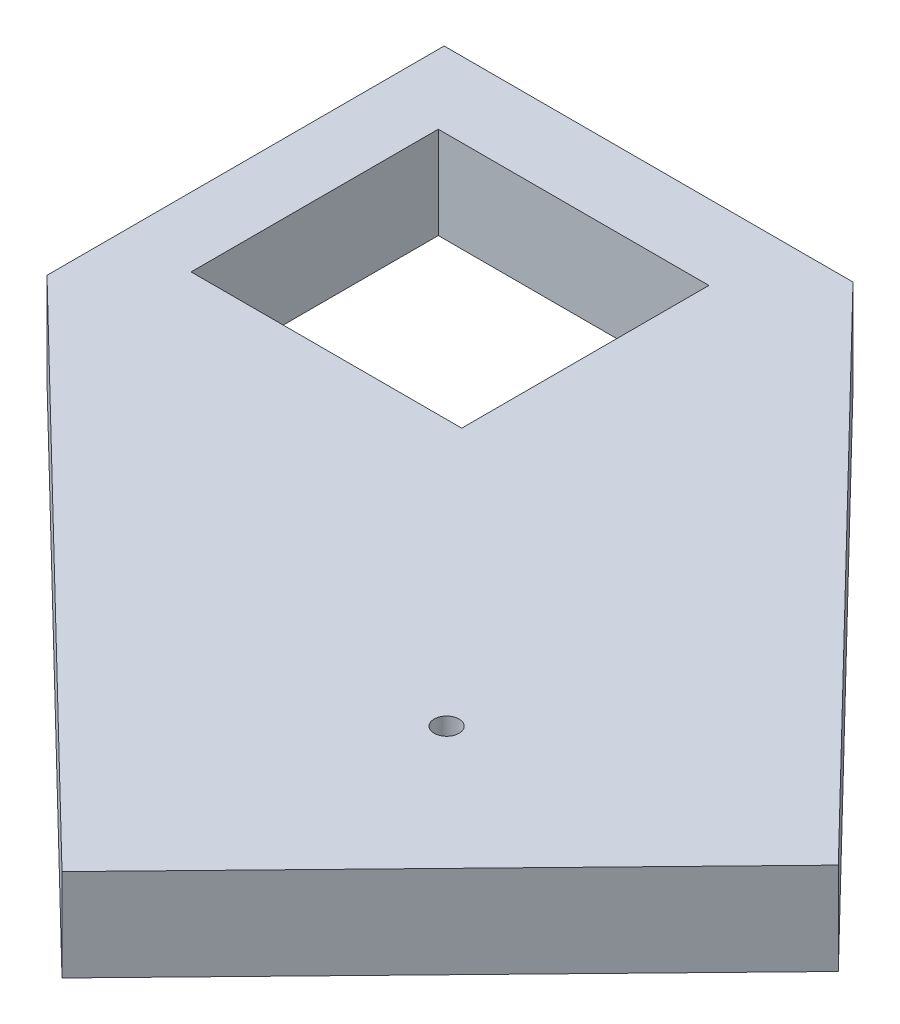
ISO-10303-21;
HEADER;
FILE_DESCRIPTION(('STEP AP214'),'2;1');
FILE_NAME('part.step','',(''),(''),'','','');
FILE_SCHEMA(('AUTOMOTIVE_DESIGN { 1 0 10303 214 1 1 1 1 }'));
ENDSEC;
DATA;
#1=APPLICATION_CONTEXT('core data for automotive mechanical design processes');
#2=APPLICATION_PROTOCOL_DEFINITION('international standard','automotive_design',2000,#1);
#3=PRODUCT_CONTEXT('',#1,'mechanical');
#4=PRODUCT('Part','Part','',(#3));
#5=PRODUCT_RELATED_PRODUCT_CATEGORY('part','',(#4));
#6=PRODUCT_DEFINITION_FORMATION('','',#4);
#7=PRODUCT_DEFINITION_CONTEXT('part definition',#1,'design');
#8=PRODUCT_DEFINITION('design','',#6,#7);
#9=PRODUCT_DEFINITION_SHAPE('','',#8);
#10=(LENGTH_UNIT() NAMED_UNIT(*) SI_UNIT(.MILLI.,.METRE.));
#11=(NAMED_UNIT(*) PLANE_ANGLE_UNIT() SI_UNIT($,.RADIAN.));
#12=(NAMED_UNIT(*) SI_UNIT($,.STERADIAN.) SOLID_ANGLE_UNIT());
#13=UNCERTAINTY_MEASURE_WITH_UNIT(LENGTH_MEASURE(1.E-05),#10,'distance_accuracy_value','');
#14=(GEOMETRIC_REPRESENTATION_CONTEXT(3) GLOBAL_UNCERTAINTY_ASSIGNED_CONTEXT((#13)) GLOBAL_UNIT_ASSIGNED_CONTEXT((#10,
#11,#12)) REPRESENTATION_CONTEXT('',''));
#15=CARTESIAN_POINT('',(0.,0.,0.));
#16=DIRECTION('',(0.,0.,1.));
#17=DIRECTION('',(1.,0.,0.));
#18=AXIS2_PLACEMENT_3D('',#15,#16,#17);
#19=CARTESIAN_POINT('',(0.,0.,0.));
#20=DIRECTION('',(0.,1.,0.));
#21=DIRECTION('',(0.,0.,1.));
#22=AXIS2_PLACEMENT_3D('',#19,#20,#21);
#23=PLANE('',#22);
#24=DIRECTION('',(0.696755470959051,0.,-0.717308729689407));
#25=VECTOR('',#24,1.);
#26=CARTESIAN_POINT('',(112.453231928364,0.,109.231076285717));
#27=LINE('',#26,#25);
#28=CARTESIAN_POINT('',(69.3630866347913,0.,153.592317310664));
#29=VERTEX_POINT('',#28);
#30=CARTESIAN_POINT('',(152.403813044756,0.,68.1020119505532));
#31=VERTEX_POINT('',#30);
#32=EDGE_CURVE('E167',#29,#31,#27,.T.);
#33=ORIENTED_EDGE('',*,*,#32,.F.);
#34=DIRECTION('',(0.717308729689407,0.,0.696755470959051));
#35=VECTOR('',#34,1.);
#36=CARTESIAN_POINT('',(-43.0901452935729,0.,44.3612410249467));
#37=LINE('',#36,#35);
#38=CARTESIAN_POINT('',(-44.3799887495983,0.,43.108355834137));
#39=VERTEX_POINT('',#38);
#40=EDGE_CURVE('E126',#39,#29,#37,.T.);
#41=ORIENTED_EDGE('',*,*,#40,.F.);
#42=DIRECTION('',(0.,0.,1.));
#43=VECTOR('',#42,1.);
#44=CARTESIAN_POINT('',(-44.3799887495983,0.,0.));
#45=LINE('',#44,#43);
#46=CARTESIAN_POINT('',(-44.3799887495983,0.,-43.1083558341369));
#47=VERTEX_POINT('',#46);
#48=EDGE_CURVE('E177',#47,#39,#45,.T.);
#49=ORIENTED_EDGE('',*,*,#48,.F.);
#50=DIRECTION('',(1.,0.,0.));
#51=VECTOR('',#50,1.);
#52=CARTESIAN_POINT('',(0.,0.,-43.1083558341369));
#53=LINE('',#52,#51);
#54=CARTESIAN_POINT('',(44.3799887495983,0.,-43.1083558341369));
#55=VERTEX_POINT('',#54);
#56=EDGE_CURVE('E174',#47,#55,#53,.T.);
#57=ORIENTED_EDGE('',*,*,#56,.T.);
#58=DIRECTION('',(-0.696755470959051,0.,-0.717308729689407));
#59=VECTOR('',#58,1.);
#60=CARTESIAN_POINT('',(44.3799887495982,0.,-43.108355834137));
#61=LINE('',#60,#59);
#62=EDGE_CURVE('E169',#31,#55,#61,.T.);
#63=ORIENTED_EDGE('',*,*,#62,.F.);
#64=EDGE_LOOP('',(#33,#41,#49,#57,#63));
#65=FACE_BOUND('',#64,.T.);
#66=DIRECTION('',(1.,0.,0.));
#67=VECTOR('',#66,1.);
#68=CARTESIAN_POINT('',(0.,0.,-26.8314545162327));
#69=LINE('',#68,#67);
#70=CARTESIAN_POINT('',(-29.3747203471553,0.,-26.8314545162327));
#71=VERTEX_POINT('',#70);
#72=CARTESIAN_POINT('',(29.3747203471553,0.,-26.8314545162327));
#73=VERTEX_POINT('',#72);
#74=EDGE_CURVE('E129',#71,#73,#69,.T.);
#75=ORIENTED_EDGE('',*,*,#74,.F.);
#76=DIRECTION('',(0.,0.,1.));
#77=VECTOR('',#76,1.);
#78=CARTESIAN_POINT('',(-29.3747203471553,0.,0.));
#79=LINE('',#78,#77);
#80=CARTESIAN_POINT('',(-29.3747203471553,0.,26.8314545162327));
#81=VERTEX_POINT('',#80);
#82=EDGE_CURVE('E158',#71,#81,#79,.T.);
#83=ORIENTED_EDGE('',*,*,#82,.T.);
#84=DIRECTION('',(1.,0.,0.));
#85=VECTOR('',#84,1.);
#86=CARTESIAN_POINT('',(0.,0.,26.8314545162327));
#87=LINE('',#86,#85);
#88=CARTESIAN_POINT('',(29.3747203471553,0.,26.8314545162327));
#89=VERTEX_POINT('',#88);
#90=EDGE_CURVE('E161',#81,#89,#87,.T.);
#91=ORIENTED_EDGE('',*,*,#90,.T.);
#92=DIRECTION('',(0.,0.,1.));
#93=VECTOR('',#92,1.);
#94=CARTESIAN_POINT('',(29.3747203471553,0.,0.));
#95=LINE('',#94,#93);
#96=EDGE_CURVE('E164',#73,#89,#95,.T.);
#97=ORIENTED_EDGE('',*,*,#96,.F.);
#98=EDGE_LOOP('',(#75,#83,#91,#97));
#99=FACE_BOUND('',#98,.T.);
#100=CARTESIAN_POINT('',(83.7590386460632,0.,84.4999571960306));
#101=DIRECTION('',(0.,1.,0.));
#102=DIRECTION('',(0.,0.,1.));
#103=AXIS2_PLACEMENT_3D('',#100,#101,#102);
#104=CIRCLE('',#103,18.);
#105=CARTESIAN_POINT('',(71.0872860916234,0.,71.7161124222918));
#106=VERTEX_POINT('',#105);
#107=EDGE_CURVE('E11',#106,#106,#104,.F.);
#108=ORIENTED_EDGE('',*,*,#107,.F.);
#109=EDGE_LOOP('',(#108));
#110=FACE_BOUND('',#109,.T.);
#111=ADVANCED_FACE('F33',(#65,#99,#110),#23,.F.);
#112=CARTESIAN_POINT('',(83.7590386460632,0.,84.4999571960306));
#113=DIRECTION('',(0.,1.,0.));
#114=DIRECTION('',(0.,0.,1.));
#115=AXIS2_PLACEMENT_3D('',#112,#113,#114);
#116=CIRCLE('',#115,2.7);
#117=CARTESIAN_POINT('',(83.7590386460632,0.,87.1999571960306));
#118=VERTEX_POINT('',#117);
#119=EDGE_CURVE('E211',#118,#118,#116,.T.);
#120=ORIENTED_EDGE('',*,*,#119,.T.);
#121=EDGE_LOOP('',(#120));
#122=FACE_BOUND('',#121,.T.);
#123=CARTESIAN_POINT('',(83.7590386460632,0.,84.4999571960306));
#124=DIRECTION('',(0.,-1.,0.));
#125=DIRECTION('',(0.,0.,-1.));
#126=AXIS2_PLACEMENT_3D('',#123,#124,#125);
#127=CIRCLE('',#126,12.);
#128=CARTESIAN_POINT('',(75.31120360977,0.,75.9773940135381));
#129=VERTEX_POINT('',#128);
#130=EDGE_CURVE('E41',#129,#129,#127,.F.);
#131=ORIENTED_EDGE('',*,*,#130,.F.);
#132=EDGE_LOOP('',(#131));
#133=FACE_BOUND('',#132,.T.);
#134=ADVANCED_FACE('F240',(#122,#133),#23,.F.);
#135=CARTESIAN_POINT('',(112.453231928364,20.,109.231076285717));
#136=DIRECTION('',(-0.717308729689407,0.,-0.696755470959051));
#137=DIRECTION('',(-0.696755470959051,0.,0.717308729689407));
#138=AXIS2_PLACEMENT_3D('',#135,#136,#137);
#139=PLANE('',#138);
#140=ORIENTED_EDGE('',*,*,#32,.T.);
#141=DIRECTION('',(0.,-1.,0.));
#142=VECTOR('',#141,1.);
#143=CARTESIAN_POINT('',(152.403813044756,20.,68.1020119505532));
#144=LINE('',#143,#142);
#145=CARTESIAN_POINT('',(152.403813044756,20.,68.1020119505532));
#146=VERTEX_POINT('',#145);
#147=EDGE_CURVE('E138',#146,#31,#144,.T.);
#148=ORIENTED_EDGE('',*,*,#147,.F.);
#149=DIRECTION('',(0.696755470959051,0.,-0.717308729689407));
#150=VECTOR('',#149,1.);
#151=CARTESIAN_POINT('',(112.453231928364,20.,109.231076285717));
#152=LINE('',#151,#150);
#153=CARTESIAN_POINT('',(69.3630866347913,20.,153.592317310664));
#154=VERTEX_POINT('',#153);
#155=EDGE_CURVE('E203',#154,#146,#152,.T.);
#156=ORIENTED_EDGE('',*,*,#155,.F.);
#157=DIRECTION('',(0.,-1.,0.));
#158=VECTOR('',#157,1.);
#159=CARTESIAN_POINT('',(69.3630866347913,20.,153.592317310664));
#160=LINE('',#159,#158);
#161=EDGE_CURVE('E130',#154,#29,#160,.T.);
#162=ORIENTED_EDGE('',*,*,#161,.T.);
#163=EDGE_LOOP('',(#140,#148,#156,#162));
#164=FACE_BOUND('',#163,.T.);
#165=ADVANCED_FACE('F199',(#164),#139,.F.);
#166=CARTESIAN_POINT('',(44.3799887495982,20.,-43.108355834137));
#167=DIRECTION('',(-0.717308729689407,0.,0.696755470959051));
#168=DIRECTION('',(0.696755470959051,0.,0.717308729689407));
#169=AXIS2_PLACEMENT_3D('',#166,#167,#168);
#170=PLANE('',#169);
#171=ORIENTED_EDGE('',*,*,#62,.T.);
#172=DIRECTION('',(0.,-1.,0.));
#173=VECTOR('',#172,1.);
#174=CARTESIAN_POINT('',(44.3799887495983,20.,-43.1083558341369));
#175=LINE('',#174,#173);
#176=CARTESIAN_POINT('',(44.3799887495983,20.,-43.1083558341369));
#177=VERTEX_POINT('',#176);
#178=EDGE_CURVE('E141',#177,#55,#175,.T.);
#179=ORIENTED_EDGE('',*,*,#178,.F.);
#180=DIRECTION('',(-0.696755470959051,0.,-0.717308729689407));
#181=VECTOR('',#180,1.);
#182=CARTESIAN_POINT('',(44.3799887495982,20.,-43.108355834137));
#183=LINE('',#182,#181);
#184=EDGE_CURVE('E224',#146,#177,#183,.T.);
#185=ORIENTED_EDGE('',*,*,#184,.F.);
#186=ORIENTED_EDGE('',*,*,#147,.T.);
#187=EDGE_LOOP('',(#171,#179,#185,#186));
#188=FACE_BOUND('',#187,.T.);
#189=ADVANCED_FACE('F197',(#188),#170,.F.);
#190=CARTESIAN_POINT('',(0.,20.,-43.1083558341369));
#191=DIRECTION('',(0.,0.,-1.));
#192=DIRECTION('',(-1.,0.,0.));
#193=AXIS2_PLACEMENT_3D('',#190,#191,#192);
#194=PLANE('',#193);
#195=ORIENTED_EDGE('',*,*,#56,.F.);
#196=DIRECTION('',(0.,-1.,0.));
#197=VECTOR('',#196,1.);
#198=CARTESIAN_POINT('',(-44.3799887495983,20.,-43.1083558341369));
#199=LINE('',#198,#197);
#200=CARTESIAN_POINT('',(-44.3799887495983,20.,-43.1083558341369));
#201=VERTEX_POINT('',#200);
#202=EDGE_CURVE('E147',#201,#47,#199,.T.);
#203=ORIENTED_EDGE('',*,*,#202,.F.);
#204=DIRECTION('',(1.,0.,0.));
#205=VECTOR('',#204,1.);
#206=CARTESIAN_POINT('',(0.,20.,-43.1083558341369));
#207=LINE('',#206,#205);
#208=EDGE_CURVE('E196',#201,#177,#207,.T.);
#209=ORIENTED_EDGE('',*,*,#208,.T.);
#210=ORIENTED_EDGE('',*,*,#178,.T.);
#211=EDGE_LOOP('',(#195,#203,#209,#210));
#212=FACE_BOUND('',#211,.T.);
#213=ADVANCED_FACE('F194',(#212),#194,.T.);
#214=CARTESIAN_POINT('',(-44.3799887495983,20.,0.));
#215=DIRECTION('',(1.,0.,0.));
#216=DIRECTION('',(0.,0.,-1.));
#217=AXIS2_PLACEMENT_3D('',#214,#215,#216);
#218=PLANE('',#217);
#219=ORIENTED_EDGE('',*,*,#48,.T.);
#220=DIRECTION('',(0.,-1.,0.));
#221=VECTOR('',#220,1.);
#222=CARTESIAN_POINT('',(-44.3799887495983,20.,43.108355834137));
#223=LINE('',#222,#221);
#224=CARTESIAN_POINT('',(-44.3799887495983,20.,43.108355834137));
#225=VERTEX_POINT('',#224);
#226=EDGE_CURVE('E133',#225,#39,#223,.T.);
#227=ORIENTED_EDGE('',*,*,#226,.F.);
#228=DIRECTION('',(0.,0.,1.));
#229=VECTOR('',#228,1.);
#230=CARTESIAN_POINT('',(-44.3799887495983,20.,0.));
#231=LINE('',#230,#229);
#232=EDGE_CURVE('E186',#201,#225,#231,.T.);
#233=ORIENTED_EDGE('',*,*,#232,.F.);
#234=ORIENTED_EDGE('',*,*,#202,.T.);
#235=EDGE_LOOP('',(#219,#227,#233,#234));
#236=FACE_BOUND('',#235,.T.);
#237=ADVANCED_FACE('F184',(#236),#218,.F.);
#238=CARTESIAN_POINT('',(0.,20.,-26.8314545162327));
#239=DIRECTION('',(0.,0.,-1.));
#240=DIRECTION('',(-1.,0.,0.));
#241=AXIS2_PLACEMENT_3D('',#238,#239,#240);
#242=PLANE('',#241);
#243=ORIENTED_EDGE('',*,*,#74,.T.);
#244=DIRECTION('',(0.,-1.,0.));
#245=VECTOR('',#244,1.);
#246=CARTESIAN_POINT('',(29.3747203471553,20.,-26.8314545162327));
#247=LINE('',#246,#245);
#248=CARTESIAN_POINT('',(29.3747203471553,20.,-26.8314545162327));
#249=VERTEX_POINT('',#248);
#250=EDGE_CURVE('E110',#249,#73,#247,.T.);
#251=ORIENTED_EDGE('',*,*,#250,.F.);
#252=DIRECTION('',(1.,0.,0.));
#253=VECTOR('',#252,1.);
#254=CARTESIAN_POINT('',(0.,20.,-26.8314545162327));
#255=LINE('',#254,#253);
#256=CARTESIAN_POINT('',(-29.3747203471553,20.,-26.8314545162327));
#257=VERTEX_POINT('',#256);
#258=EDGE_CURVE('E117',#257,#249,#255,.T.);
#259=ORIENTED_EDGE('',*,*,#258,.F.);
#260=DIRECTION('',(0.,-1.,0.));
#261=VECTOR('',#260,1.);
#262=CARTESIAN_POINT('',(-29.3747203471553,20.,-26.8314545162327));
#263=LINE('',#262,#261);
#264=EDGE_CURVE('E151',#257,#71,#263,.T.);
#265=ORIENTED_EDGE('',*,*,#264,.T.);
#266=EDGE_LOOP('',(#243,#251,#259,#265));
#267=FACE_BOUND('',#266,.T.);
#268=ADVANCED_FACE('F35',(#267),#242,.F.);
#269=CARTESIAN_POINT('',(29.3747203471553,20.,0.));
#270=DIRECTION('',(1.,0.,0.));
#271=DIRECTION('',(0.,0.,-1.));
#272=AXIS2_PLACEMENT_3D('',#269,#270,#271);
#273=PLANE('',#272);
#274=ORIENTED_EDGE('',*,*,#96,.T.);
#275=DIRECTION('',(0.,-1.,0.));
#276=VECTOR('',#275,1.);
#277=CARTESIAN_POINT('',(29.3747203471553,20.,26.8314545162327));
#278=LINE('',#277,#276);
#279=CARTESIAN_POINT('',(29.3747203471553,20.,26.8314545162327));
#280=VERTEX_POINT('',#279);
#281=EDGE_CURVE('E112',#280,#89,#278,.T.);
#282=ORIENTED_EDGE('',*,*,#281,.F.);
#283=DIRECTION('',(0.,0.,1.));
#284=VECTOR('',#283,1.);
#285=CARTESIAN_POINT('',(29.3747203471553,20.,0.));
#286=LINE('',#285,#284);
#287=EDGE_CURVE('E105',#249,#280,#286,.T.);
#288=ORIENTED_EDGE('',*,*,#287,.F.);
#289=ORIENTED_EDGE('',*,*,#250,.T.);
#290=EDGE_LOOP('',(#274,#282,#288,#289));
#291=FACE_BOUND('',#290,.T.);
#292=ADVANCED_FACE('F108',(#291),#273,.F.);
#293=CARTESIAN_POINT('',(0.,20.,26.8314545162327));
#294=DIRECTION('',(0.,0.,-1.));
#295=DIRECTION('',(-1.,0.,0.));
#296=AXIS2_PLACEMENT_3D('',#293,#294,#295);
#297=PLANE('',#296);
#298=ORIENTED_EDGE('',*,*,#90,.F.);
#299=DIRECTION('',(0.,-1.,0.));
#300=VECTOR('',#299,1.);
#301=CARTESIAN_POINT('',(-29.3747203471553,20.,26.8314545162327));
#302=LINE('',#301,#300);
#303=CARTESIAN_POINT('',(-29.3747203471553,20.,26.8314545162327));
#304=VERTEX_POINT('',#303);
#305=EDGE_CURVE('E135',#304,#81,#302,.T.);
#306=ORIENTED_EDGE('',*,*,#305,.F.);
#307=DIRECTION('',(1.,0.,0.));
#308=VECTOR('',#307,1.);
#309=CARTESIAN_POINT('',(0.,20.,26.8314545162327));
#310=LINE('',#309,#308);
#311=EDGE_CURVE('E116',#304,#280,#310,.T.);
#312=ORIENTED_EDGE('',*,*,#311,.T.);
#313=ORIENTED_EDGE('',*,*,#281,.T.);
#314=EDGE_LOOP('',(#298,#306,#312,#313));
#315=FACE_BOUND('',#314,.T.);
#316=ADVANCED_FACE('F162',(#315),#297,.T.);
#317=CARTESIAN_POINT('',(-29.3747203471553,20.,0.));
#318=DIRECTION('',(1.,0.,0.));
#319=DIRECTION('',(0.,0.,-1.));
#320=AXIS2_PLACEMENT_3D('',#317,#318,#319);
#321=PLANE('',#320);
#322=ORIENTED_EDGE('',*,*,#82,.F.);
#323=ORIENTED_EDGE('',*,*,#264,.F.);
#324=DIRECTION('',(0.,0.,1.));
#325=VECTOR('',#324,1.);
#326=CARTESIAN_POINT('',(-29.3747203471553,20.,0.));
#327=LINE('',#326,#325);
#328=EDGE_CURVE('E124',#257,#304,#327,.T.);
#329=ORIENTED_EDGE('',*,*,#328,.T.);
#330=ORIENTED_EDGE('',*,*,#305,.T.);
#331=EDGE_LOOP('',(#322,#323,#329,#330));
#332=FACE_BOUND('',#331,.T.);
#333=ADVANCED_FACE('F156',(#332),#321,.T.);
#334=CARTESIAN_POINT('',(-43.0901452935729,20.,44.3612410249467));
#335=DIRECTION('',(0.696755470959051,0.,-0.717308729689407));
#336=DIRECTION('',(-0.717308729689407,0.,-0.696755470959051));
#337=AXIS2_PLACEMENT_3D('',#334,#335,#336);
#338=PLANE('',#337);
#339=ORIENTED_EDGE('',*,*,#40,.T.);
#340=ORIENTED_EDGE('',*,*,#161,.F.);
#341=DIRECTION('',(0.717308729689407,0.,0.696755470959051));
#342=VECTOR('',#341,1.);
#343=CARTESIAN_POINT('',(-43.0901452935729,20.,44.3612410249467));
#344=LINE('',#343,#342);
#345=EDGE_CURVE('E152',#225,#154,#344,.T.);
#346=ORIENTED_EDGE('',*,*,#345,.F.);
#347=ORIENTED_EDGE('',*,*,#226,.T.);
#348=EDGE_LOOP('',(#339,#340,#346,#347));
#349=FACE_BOUND('',#348,.T.);
#350=ADVANCED_FACE('F206',(#349),#338,.F.);
#351=CARTESIAN_POINT('',(0.,20.,0.));
#352=DIRECTION('',(0.,1.,0.));
#353=DIRECTION('',(0.,0.,1.));
#354=AXIS2_PLACEMENT_3D('',#351,#352,#353);
#355=PLANE('',#354);
#356=CARTESIAN_POINT('',(83.7590386460632,20.,84.4999571960306));
#357=DIRECTION('',(0.,1.,0.));
#358=DIRECTION('',(0.,0.,1.));
#359=AXIS2_PLACEMENT_3D('',#356,#357,#358);
#360=CIRCLE('',#359,2.7);
#361=CARTESIAN_POINT('',(83.7590386460632,20.,87.1999571960306));
#362=VERTEX_POINT('',#361);
#363=EDGE_CURVE('E213',#362,#362,#360,.T.);
#364=ORIENTED_EDGE('',*,*,#363,.F.);
#365=EDGE_LOOP('',(#364));
#366=FACE_BOUND('',#365,.T.);
#367=ORIENTED_EDGE('',*,*,#258,.T.);
#368=ORIENTED_EDGE('',*,*,#287,.T.);
#369=ORIENTED_EDGE('',*,*,#311,.F.);
#370=ORIENTED_EDGE('',*,*,#328,.F.);
#371=EDGE_LOOP('',(#367,#368,#369,#370));
#372=FACE_BOUND('',#371,.T.);
#373=ORIENTED_EDGE('',*,*,#155,.T.);
#374=ORIENTED_EDGE('',*,*,#184,.T.);
#375=ORIENTED_EDGE('',*,*,#208,.F.);
#376=ORIENTED_EDGE('',*,*,#232,.T.);
#377=ORIENTED_EDGE('',*,*,#345,.T.);
#378=EDGE_LOOP('',(#373,#374,#375,#376,#377));
#379=FACE_BOUND('',#378,.T.);
#380=ADVANCED_FACE('F121',(#366,#372,#379),#355,.T.);
#381=CARTESIAN_POINT('',(83.7590386460632,0.,84.4999571960306));
#382=DIRECTION('',(0.,1.,0.));
#383=DIRECTION('',(0.,0.,1.));
#384=AXIS2_PLACEMENT_3D('',#381,#382,#383);
#385=CYLINDRICAL_SURFACE('',#384,2.7);
#386=ORIENTED_EDGE('',*,*,#119,.F.);
#387=EDGE_LOOP('',(#386));
#388=FACE_BOUND('',#387,.T.);
#389=ORIENTED_EDGE('',*,*,#363,.T.);
#390=EDGE_LOOP('',(#389));
#391=FACE_BOUND('',#390,.T.);
#392=ADVANCED_FACE('F226',(#388,#391),#385,.F.);
#393=CARTESIAN_POINT('',(83.7590386460632,0.,84.4999571960306));
#394=DIRECTION('',(0.,-1.,0.));
#395=DIRECTION('',(0.,0.,-1.));
#396=AXIS2_PLACEMENT_3D('',#393,#394,#395);
#397=TOROIDAL_SURFACE('',#396,15.,3.00000000000001);
#398=ORIENTED_EDGE('',*,*,#107,.T.);
#399=CARTESIAN_POINT('',(73.1992448506967,0.,73.846753217915));
#400=DIRECTION('',(-0.710213598541042,0.,0.703986253024435));
#401=DIRECTION('',(0.703986253024435,0.,0.710213598541042));
#402=AXIS2_PLACEMENT_3D('',#399,#400,#401);
#403=CIRCLE('',#402,3.00000000000001);
#404=EDGE_CURVE('E47',#129,#106,#403,.T.);
#405=ORIENTED_EDGE('',*,*,#404,.F.);
#406=ORIENTED_EDGE('',*,*,#130,.T.);
#407=ORIENTED_EDGE('',*,*,#404,.T.);
#408=EDGE_LOOP('',(#398,#405,#406,#407));
#409=FACE_BOUND('',#408,.T.);
#410=ADVANCED_FACE('F233',(#409),#397,.F.);
#411=CLOSED_SHELL('',(#111,#134,#165,#189,#213,#237,#268,#292,#316,#333,#350,#380,#392,#410));
#412=MANIFOLD_SOLID_BREP('B2',#411);
#413=ADVANCED_BREP_SHAPE_REPRESENTATION('',(#18,#412),#14);
#414=SHAPE_DEFINITION_REPRESENTATION(#9,#413);
ENDSEC;
END-ISO-10303-21;
